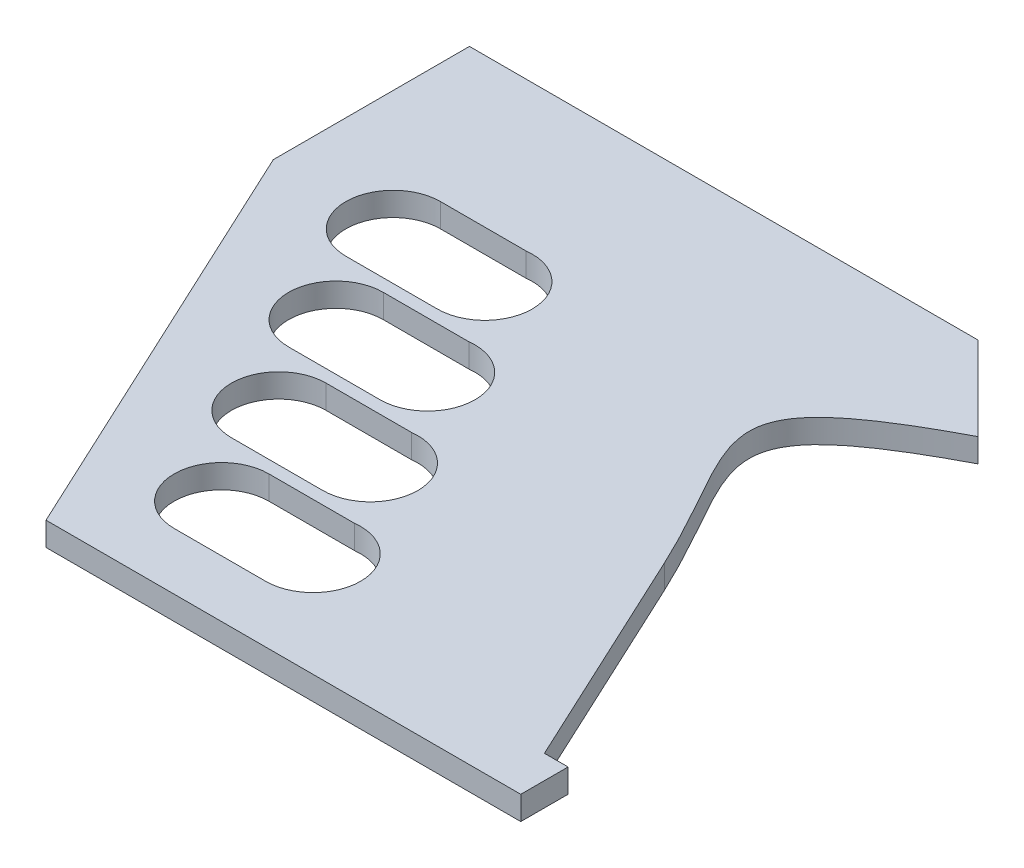
ISO-10303-21;
HEADER;
FILE_DESCRIPTION(('STEP AP214'),'2;1');
FILE_NAME('part.step','',(''),(''),'','','');
FILE_SCHEMA(('AUTOMOTIVE_DESIGN { 1 0 10303 214 1 1 1 1 }'));
ENDSEC;
DATA;
#1=APPLICATION_CONTEXT('core data for automotive mechanical design processes');
#2=APPLICATION_PROTOCOL_DEFINITION('international standard','automotive_design',2000,#1);
#3=PRODUCT_CONTEXT('',#1,'mechanical');
#4=PRODUCT('Part','Part','',(#3));
#5=PRODUCT_RELATED_PRODUCT_CATEGORY('part','',(#4));
#6=PRODUCT_DEFINITION_FORMATION('','',#4);
#7=PRODUCT_DEFINITION_CONTEXT('part definition',#1,'design');
#8=PRODUCT_DEFINITION('design','',#6,#7);
#9=PRODUCT_DEFINITION_SHAPE('','',#8);
#10=(LENGTH_UNIT() NAMED_UNIT(*) SI_UNIT(.MILLI.,.METRE.));
#11=(NAMED_UNIT(*) PLANE_ANGLE_UNIT() SI_UNIT($,.RADIAN.));
#12=(NAMED_UNIT(*) SI_UNIT($,.STERADIAN.) SOLID_ANGLE_UNIT());
#13=UNCERTAINTY_MEASURE_WITH_UNIT(LENGTH_MEASURE(1.E-05),#10,'distance_accuracy_value','');
#14=(GEOMETRIC_REPRESENTATION_CONTEXT(3) GLOBAL_UNCERTAINTY_ASSIGNED_CONTEXT((#13)) GLOBAL_UNIT_ASSIGNED_CONTEXT((#10,
#11,#12)) REPRESENTATION_CONTEXT('',''));
#15=CARTESIAN_POINT('',(0.,0.,0.));
#16=DIRECTION('',(0.,0.,1.));
#17=DIRECTION('',(1.,0.,0.));
#18=AXIS2_PLACEMENT_3D('',#15,#16,#17);
#19=CARTESIAN_POINT('',(29.4240304492377,5.,-17.6776695296636));
#20=DIRECTION('',(-0.707106781186543,0.,0.707106781186552));
#21=DIRECTION('',(0.707106781186552,0.,0.707106781186543));
#22=AXIS2_PLACEMENT_3D('',#19,#20,#21);
#23=PLANE('',#22);
#24=DIRECTION('',(-0.707106781186552,0.,-0.707106781186543));
#25=VECTOR('',#24,1.);
#26=CARTESIAN_POINT('',(29.4240304492377,0.,-17.6776695296636));
#27=LINE('',#26,#25);
#28=CARTESIAN_POINT('',(47.1016999789015,0.,0.));
#29=VERTEX_POINT('',#28);
#30=CARTESIAN_POINT('',(29.4240304492377,0.,-17.6776695296636));
#31=VERTEX_POINT('',#30);
#32=EDGE_CURVE('E328',#29,#31,#27,.T.);
#33=ORIENTED_EDGE('',*,*,#32,.T.);
#34=DIRECTION('',(0.,-1.,0.));
#35=VECTOR('',#34,1.);
#36=CARTESIAN_POINT('',(29.4240304492377,5.,-17.6776695296636));
#37=LINE('',#36,#35);
#38=CARTESIAN_POINT('',(29.4240304492377,5.,-17.6776695296636));
#39=VERTEX_POINT('',#38);
#40=EDGE_CURVE('E12',#39,#31,#37,.T.);
#41=ORIENTED_EDGE('',*,*,#40,.F.);
#42=DIRECTION('',(-0.707106781186552,0.,-0.707106781186543));
#43=VECTOR('',#42,1.);
#44=CARTESIAN_POINT('',(29.4240304492377,5.,-17.6776695296636));
#45=LINE('',#44,#43);
#46=CARTESIAN_POINT('',(47.1016999789015,5.,0.));
#47=VERTEX_POINT('',#46);
#48=EDGE_CURVE('E335',#47,#39,#45,.T.);
#49=ORIENTED_EDGE('',*,*,#48,.F.);
#50=DIRECTION('',(0.,-1.,0.));
#51=VECTOR('',#50,1.);
#52=CARTESIAN_POINT('',(47.1016999789015,5.,0.));
#53=LINE('',#52,#51);
#54=EDGE_CURVE('E358',#47,#29,#53,.T.);
#55=ORIENTED_EDGE('',*,*,#54,.T.);
#56=EDGE_LOOP('',(#33,#41,#49,#55));
#57=FACE_BOUND('',#56,.T.);
#58=ADVANCED_FACE('F36',(#57),#23,.F.);
#59=CARTESIAN_POINT('',(29.4240304492377,5.,-17.6776695296636));
#60=DIRECTION('',(0.,0.,1.));
#61=DIRECTION('',(1.,0.,0.));
#62=AXIS2_PLACEMENT_3D('',#59,#60,#61);
#63=PLANE('',#62);
#64=DIRECTION('',(-1.,0.,0.));
#65=VECTOR('',#64,1.);
#66=CARTESIAN_POINT('',(29.4240304492377,0.,-17.6776695296636));
#67=LINE('',#66,#65);
#68=CARTESIAN_POINT('',(-78.0525825981431,0.,-17.6776695296636));
#69=VERTEX_POINT('',#68);
#70=EDGE_CURVE('E402',#31,#69,#67,.T.);
#71=ORIENTED_EDGE('',*,*,#70,.T.);
#72=DIRECTION('',(0.,-1.,0.));
#73=VECTOR('',#72,1.);
#74=CARTESIAN_POINT('',(-78.0525825981431,5.,-17.6776695296636));
#75=LINE('',#74,#73);
#76=CARTESIAN_POINT('',(-78.0525825981431,5.,-17.6776695296636));
#77=VERTEX_POINT('',#76);
#78=EDGE_CURVE('E43',#77,#69,#75,.T.);
#79=ORIENTED_EDGE('',*,*,#78,.F.);
#80=DIRECTION('',(-1.,0.,0.));
#81=VECTOR('',#80,1.);
#82=CARTESIAN_POINT('',(29.4240304492377,5.,-17.6776695296636));
#83=LINE('',#82,#81);
#84=EDGE_CURVE('E338',#39,#77,#83,.T.);
#85=ORIENTED_EDGE('',*,*,#84,.F.);
#86=ORIENTED_EDGE('',*,*,#40,.T.);
#87=EDGE_LOOP('',(#71,#79,#85,#86));
#88=FACE_BOUND('',#87,.T.);
#89=ADVANCED_FACE('F393',(#88),#63,.F.);
#90=CARTESIAN_POINT('',(-78.0525825981431,5.,-17.6776695296636));
#91=DIRECTION('',(1.,0.,0.));
#92=DIRECTION('',(0.,0.,-1.));
#93=AXIS2_PLACEMENT_3D('',#90,#91,#92);
#94=PLANE('',#93);
#95=DIRECTION('',(0.,0.,1.));
#96=VECTOR('',#95,1.);
#97=CARTESIAN_POINT('',(-78.0525825981431,0.,-17.6776695296636));
#98=LINE('',#97,#96);
#99=CARTESIAN_POINT('',(-78.0525825981431,0.,23.7799884102785));
#100=VERTEX_POINT('',#99);
#101=EDGE_CURVE('E410',#69,#100,#98,.T.);
#102=ORIENTED_EDGE('',*,*,#101,.T.);
#103=DIRECTION('',(0.,-1.,0.));
#104=VECTOR('',#103,1.);
#105=CARTESIAN_POINT('',(-78.0525825981431,5.,23.7799884102785));
#106=LINE('',#105,#104);
#107=CARTESIAN_POINT('',(-78.0525825981431,5.,23.7799884102785));
#108=VERTEX_POINT('',#107);
#109=EDGE_CURVE('E413',#108,#100,#106,.T.);
#110=ORIENTED_EDGE('',*,*,#109,.F.);
#111=DIRECTION('',(0.,0.,1.));
#112=VECTOR('',#111,1.);
#113=CARTESIAN_POINT('',(-78.0525825981431,5.,-17.6776695296636));
#114=LINE('',#113,#112);
#115=EDGE_CURVE('E341',#77,#108,#114,.T.);
#116=ORIENTED_EDGE('',*,*,#115,.F.);
#117=ORIENTED_EDGE('',*,*,#78,.T.);
#118=EDGE_LOOP('',(#102,#110,#116,#117));
#119=FACE_BOUND('',#118,.T.);
#120=ADVANCED_FACE('F390',(#119),#94,.F.);
#121=CARTESIAN_POINT('',(-78.0525825981431,5.,23.7799884102785));
#122=DIRECTION('',(0.906307787036651,0.,-0.422618261740697));
#123=DIRECTION('',(-0.422618261740697,0.,-0.906307787036651));
#124=AXIS2_PLACEMENT_3D('',#121,#122,#123);
#125=PLANE('',#124);
#126=DIRECTION('',(0.422618261740697,0.,0.906307787036651));
#127=VECTOR('',#126,1.);
#128=CARTESIAN_POINT('',(-78.0525825981431,0.,23.7799884102785));
#129=LINE('',#128,#127);
#130=CARTESIAN_POINT('',(-36.0848933641935,0.,113.779988410278));
#131=VERTEX_POINT('',#130);
#132=EDGE_CURVE('E416',#100,#131,#129,.T.);
#133=ORIENTED_EDGE('',*,*,#132,.T.);
#134=DIRECTION('',(0.,-1.,0.));
#135=VECTOR('',#134,1.);
#136=CARTESIAN_POINT('',(-36.0848933641935,5.,113.779988410278));
#137=LINE('',#136,#135);
#138=CARTESIAN_POINT('',(-36.0848933641935,5.,113.779988410278));
#139=VERTEX_POINT('',#138);
#140=EDGE_CURVE('E448',#139,#131,#137,.T.);
#141=ORIENTED_EDGE('',*,*,#140,.F.);
#142=DIRECTION('',(0.422618261740697,0.,0.906307787036651));
#143=VECTOR('',#142,1.);
#144=CARTESIAN_POINT('',(-78.0525825981431,5.,23.7799884102785));
#145=LINE('',#144,#143);
#146=EDGE_CURVE('E343',#108,#139,#145,.T.);
#147=ORIENTED_EDGE('',*,*,#146,.F.);
#148=ORIENTED_EDGE('',*,*,#109,.T.);
#149=EDGE_LOOP('',(#133,#141,#147,#148));
#150=FACE_BOUND('',#149,.T.);
#151=ADVANCED_FACE('F386',(#150),#125,.F.);
#152=CARTESIAN_POINT('',(-36.0848933641935,5.,113.779988410278));
#153=DIRECTION('',(0.,0.,-1.));
#154=DIRECTION('',(-1.,0.,0.));
#155=AXIS2_PLACEMENT_3D('',#152,#153,#154);
#156=PLANE('',#155);
#157=DIRECTION('',(1.,0.,0.));
#158=VECTOR('',#157,1.);
#159=CARTESIAN_POINT('',(-36.0848933641935,0.,113.779988410278));
#160=LINE('',#159,#158);
#161=CARTESIAN_POINT('',(64.2520300542566,0.,113.779988410278));
#162=VERTEX_POINT('',#161);
#163=EDGE_CURVE('E418',#131,#162,#160,.T.);
#164=ORIENTED_EDGE('',*,*,#163,.T.);
#165=DIRECTION('',(0.,-1.,0.));
#166=VECTOR('',#165,1.);
#167=CARTESIAN_POINT('',(64.2520300542566,5.,113.779988410278));
#168=LINE('',#167,#166);
#169=CARTESIAN_POINT('',(64.2520300542566,5.,113.779988410278));
#170=VERTEX_POINT('',#169);
#171=EDGE_CURVE('E445',#170,#162,#168,.T.);
#172=ORIENTED_EDGE('',*,*,#171,.F.);
#173=DIRECTION('',(1.,0.,0.));
#174=VECTOR('',#173,1.);
#175=CARTESIAN_POINT('',(-36.0848933641935,5.,113.779988410278));
#176=LINE('',#175,#174);
#177=EDGE_CURVE('E345',#139,#170,#176,.T.);
#178=ORIENTED_EDGE('',*,*,#177,.F.);
#179=ORIENTED_EDGE('',*,*,#140,.T.);
#180=EDGE_LOOP('',(#164,#172,#178,#179));
#181=FACE_BOUND('',#180,.T.);
#182=ADVANCED_FACE('F382',(#181),#156,.F.);
#183=CARTESIAN_POINT('',(64.2520300542566,5.,113.779988410278));
#184=DIRECTION('',(-1.,0.,0.));
#185=DIRECTION('',(0.,0.,1.));
#186=AXIS2_PLACEMENT_3D('',#183,#184,#185);
#187=PLANE('',#186);
#188=DIRECTION('',(0.,0.,-1.));
#189=VECTOR('',#188,1.);
#190=CARTESIAN_POINT('',(64.2520300542566,0.,113.779988410278));
#191=LINE('',#190,#189);
#192=CARTESIAN_POINT('',(64.2520300542566,0.,103.779988410278));
#193=VERTEX_POINT('',#192);
#194=EDGE_CURVE('E422',#162,#193,#191,.T.);
#195=ORIENTED_EDGE('',*,*,#194,.T.);
#196=DIRECTION('',(0.,-1.,0.));
#197=VECTOR('',#196,1.);
#198=CARTESIAN_POINT('',(64.2520300542566,5.,103.779988410278));
#199=LINE('',#198,#197);
#200=CARTESIAN_POINT('',(64.2520300542566,5.,103.779988410278));
#201=VERTEX_POINT('',#200);
#202=EDGE_CURVE('E442',#201,#193,#199,.T.);
#203=ORIENTED_EDGE('',*,*,#202,.F.);
#204=DIRECTION('',(0.,0.,-1.));
#205=VECTOR('',#204,1.);
#206=CARTESIAN_POINT('',(64.2520300542566,5.,113.779988410278));
#207=LINE('',#206,#205);
#208=EDGE_CURVE('E347',#170,#201,#207,.T.);
#209=ORIENTED_EDGE('',*,*,#208,.F.);
#210=ORIENTED_EDGE('',*,*,#171,.T.);
#211=EDGE_LOOP('',(#195,#203,#209,#210));
#212=FACE_BOUND('',#211,.T.);
#213=ADVANCED_FACE('F378',(#212),#187,.F.);
#214=CARTESIAN_POINT('',(64.2520300542566,5.,103.779988410278));
#215=DIRECTION('',(0.,0.,1.));
#216=DIRECTION('',(1.,0.,0.));
#217=AXIS2_PLACEMENT_3D('',#214,#215,#216);
#218=PLANE('',#217);
#219=DIRECTION('',(-1.,0.,0.));
#220=VECTOR('',#219,1.);
#221=CARTESIAN_POINT('',(64.2520300542566,0.,103.779988410278));
#222=LINE('',#221,#220);
#223=CARTESIAN_POINT('',(59.2520300542566,0.,103.779988410278));
#224=VERTEX_POINT('',#223);
#225=EDGE_CURVE('E424',#193,#224,#222,.T.);
#226=ORIENTED_EDGE('',*,*,#225,.T.);
#227=DIRECTION('',(0.,-1.,0.));
#228=VECTOR('',#227,1.);
#229=CARTESIAN_POINT('',(59.2520300542566,5.,103.779988410278));
#230=LINE('',#229,#228);
#231=CARTESIAN_POINT('',(59.2520300542566,5.,103.779988410278));
#232=VERTEX_POINT('',#231);
#233=EDGE_CURVE('E439',#232,#224,#230,.T.);
#234=ORIENTED_EDGE('',*,*,#233,.F.);
#235=DIRECTION('',(-1.,0.,0.));
#236=VECTOR('',#235,1.);
#237=CARTESIAN_POINT('',(64.2520300542566,5.,103.779988410278));
#238=LINE('',#237,#236);
#239=EDGE_CURVE('E349',#201,#232,#238,.T.);
#240=ORIENTED_EDGE('',*,*,#239,.F.);
#241=ORIENTED_EDGE('',*,*,#202,.T.);
#242=EDGE_LOOP('',(#226,#234,#240,#241));
#243=FACE_BOUND('',#242,.T.);
#244=ADVANCED_FACE('F374',(#243),#218,.F.);
#245=CARTESIAN_POINT('',(59.2520300542566,5.,103.779988410278));
#246=DIRECTION('',(-0.906307787036651,0.,0.422618261740698));
#247=DIRECTION('',(0.422618261740698,0.,0.906307787036651));
#248=AXIS2_PLACEMENT_3D('',#245,#246,#247);
#249=PLANE('',#248);
#250=DIRECTION('',(-0.422618261740698,0.,-0.906307787036651));
#251=VECTOR('',#250,1.);
#252=CARTESIAN_POINT('',(59.2520300542566,0.,103.779988410278));
#253=LINE('',#252,#251);
#254=CARTESIAN_POINT('',(37.1043773492888,0.,56.2841939114326));
#255=VERTEX_POINT('',#254);
#256=EDGE_CURVE('E426',#224,#255,#253,.T.);
#257=ORIENTED_EDGE('',*,*,#256,.T.);
#258=DIRECTION('',(0.,-1.,0.));
#259=VECTOR('',#258,1.);
#260=CARTESIAN_POINT('',(37.1043773492888,5.,56.2841939114326));
#261=LINE('',#260,#259);
#262=CARTESIAN_POINT('',(37.1043773492888,5.,56.2841939114326));
#263=VERTEX_POINT('',#262);
#264=EDGE_CURVE('E436',#263,#255,#261,.T.);
#265=ORIENTED_EDGE('',*,*,#264,.F.);
#266=DIRECTION('',(-0.422618261740698,0.,-0.906307787036651));
#267=VECTOR('',#266,1.);
#268=CARTESIAN_POINT('',(59.2520300542566,5.,103.779988410278));
#269=LINE('',#268,#267);
#270=EDGE_CURVE('E351',#232,#263,#269,.T.);
#271=ORIENTED_EDGE('',*,*,#270,.F.);
#272=ORIENTED_EDGE('',*,*,#233,.T.);
#273=EDGE_LOOP('',(#257,#265,#271,#272));
#274=FACE_BOUND('',#273,.T.);
#275=ADVANCED_FACE('F369',(#274),#249,.F.);
#276=CARTESIAN_POINT('',(37.1043773492888,5.,56.2841939114326));
#277=CARTESIAN_POINT('',(22.607602938361,5.,25.1957608621317));
#278=CARTESIAN_POINT('',(7.91637544928709,5.,20.5329928361789));
#279=CARTESIAN_POINT('',(47.1016999789015,5.,0.));
#280=B_SPLINE_CURVE_WITH_KNOTS('',3,(#276,#277,#278,#279),.UNSPECIFIED.,.F.,.F.,(4,4),(0.,1.),.UNSPECIFIED.);
#281=DIRECTION('',(0.,-1.,0.));
#282=VECTOR('',#281,1.);
#283=SURFACE_OF_LINEAR_EXTRUSION('',#280,#282);
#284=CARTESIAN_POINT('',(37.1043773492888,0.,56.2841939114326));
#285=CARTESIAN_POINT('',(22.607602938361,0.,25.1957608621317));
#286=CARTESIAN_POINT('',(7.91637544928709,0.,20.5329928361789));
#287=CARTESIAN_POINT('',(47.1016999789015,0.,0.));
#288=B_SPLINE_CURVE_WITH_KNOTS('',3,(#284,#285,#286,#287),.UNSPECIFIED.,.F.,.F.,(4,4),(0.,1.),.UNSPECIFIED.);
#289=EDGE_CURVE('E339',#255,#29,#288,.T.);
#290=ORIENTED_EDGE('',*,*,#289,.T.);
#291=ORIENTED_EDGE('',*,*,#54,.F.);
#292=EDGE_CURVE('E353',#263,#47,#280,.T.);
#293=ORIENTED_EDGE('',*,*,#292,.F.);
#294=ORIENTED_EDGE('',*,*,#264,.T.);
#295=EDGE_LOOP('',(#290,#291,#293,#294));
#296=FACE_BOUND('',#295,.T.);
#297=ADVANCED_FACE('F364',(#296),#283,.F.);
#298=CARTESIAN_POINT('',(21.9722515613918,5.,24.1838068757956));
#299=DIRECTION('',(0.,-1.,0.));
#300=DIRECTION('',(0.,0.,-1.));
#301=AXIS2_PLACEMENT_3D('',#298,#299,#300);
#302=PLANE('',#301);
#303=DIRECTION('',(1.,0.,0.));
#304=VECTOR('',#303,1.);
#305=CARTESIAN_POINT('',(-11.6931363860408,5.,101.753072438027));
#306=LINE('',#305,#304);
#307=CARTESIAN_POINT('',(-21.0192895491407,5.,101.753072438027));
#308=VERTEX_POINT('',#307);
#309=CARTESIAN_POINT('',(-1.69313638604082,5.,101.753072438027));
#310=VERTEX_POINT('',#309);
#311=EDGE_CURVE('E229',#308,#310,#306,.T.);
#312=ORIENTED_EDGE('',*,*,#311,.F.);
#313=CARTESIAN_POINT('',(-21.0192895491407,5.,91.7530724380273));
#314=DIRECTION('',(0.,1.,0.));
#315=DIRECTION('',(0.,0.,1.));
#316=AXIS2_PLACEMENT_3D('',#313,#314,#315);
#317=CIRCLE('',#316,10.);
#318=CARTESIAN_POINT('',(-21.0192895491407,5.,81.7530724380273));
#319=VERTEX_POINT('',#318);
#320=EDGE_CURVE('E50',#319,#308,#317,.T.);
#321=ORIENTED_EDGE('',*,*,#320,.F.);
#322=DIRECTION('',(-1.,0.,0.));
#323=VECTOR('',#322,1.);
#324=CARTESIAN_POINT('',(-21.0192895491407,5.,81.7530724380273));
#325=LINE('',#324,#323);
#326=CARTESIAN_POINT('',(-2.91410948383002,5.,81.7530724380273));
#327=VERTEX_POINT('',#326);
#328=EDGE_CURVE('E220',#327,#319,#325,.T.);
#329=ORIENTED_EDGE('',*,*,#328,.F.);
#330=CARTESIAN_POINT('',(-1.69313638604082,5.,91.7158030553892));
#331=DIRECTION('',(0.,1.,0.));
#332=DIRECTION('',(0.,0.,1.));
#333=AXIS2_PLACEMENT_3D('',#330,#331,#332);
#334=CIRCLE('',#333,10.0372693826381);
#335=EDGE_CURVE('E223',#310,#327,#334,.T.);
#336=ORIENTED_EDGE('',*,*,#335,.F.);
#337=EDGE_LOOP('',(#312,#321,#329,#336));
#338=FACE_BOUND('',#337,.T.);
#339=DIRECTION('',(1.,0.,0.));
#340=VECTOR('',#339,1.);
#341=CARTESIAN_POINT('',(-22.2585929295582,5.,79.0953777621111));
#342=LINE('',#341,#340);
#343=CARTESIAN_POINT('',(-31.5847460926582,5.,79.0953777621111));
#344=VERTEX_POINT('',#343);
#345=CARTESIAN_POINT('',(-12.2585929295582,5.,79.0953777621111));
#346=VERTEX_POINT('',#345);
#347=EDGE_CURVE('E254',#344,#346,#342,.T.);
#348=ORIENTED_EDGE('',*,*,#347,.F.);
#349=CARTESIAN_POINT('',(-31.5847460926582,5.,69.0953777621111));
#350=DIRECTION('',(0.,1.,0.));
#351=DIRECTION('',(0.,0.,1.));
#352=AXIS2_PLACEMENT_3D('',#349,#350,#351);
#353=CIRCLE('',#352,10.);
#354=CARTESIAN_POINT('',(-31.5847460926582,5.,59.095377762111));
#355=VERTEX_POINT('',#354);
#356=EDGE_CURVE('E235',#355,#344,#353,.T.);
#357=ORIENTED_EDGE('',*,*,#356,.F.);
#358=DIRECTION('',(-1.,0.,0.));
#359=VECTOR('',#358,1.);
#360=CARTESIAN_POINT('',(-31.5847460926582,5.,59.095377762111));
#361=LINE('',#360,#359);
#362=CARTESIAN_POINT('',(-13.4795660273474,5.,59.095377762111));
#363=VERTEX_POINT('',#362);
#364=EDGE_CURVE('E243',#363,#355,#361,.T.);
#365=ORIENTED_EDGE('',*,*,#364,.F.);
#366=CARTESIAN_POINT('',(-12.2585929295582,5.,69.0581083794729));
#367=DIRECTION('',(0.,1.,0.));
#368=DIRECTION('',(0.,0.,1.));
#369=AXIS2_PLACEMENT_3D('',#366,#367,#368);
#370=CIRCLE('',#369,10.0372693826381);
#371=EDGE_CURVE('E257',#346,#363,#370,.T.);
#372=ORIENTED_EDGE('',*,*,#371,.F.);
#373=EDGE_LOOP('',(#348,#357,#365,#372));
#374=FACE_BOUND('',#373,.T.);
#375=DIRECTION('',(1.,0.,0.));
#376=VECTOR('',#375,1.);
#377=CARTESIAN_POINT('',(-32.8240494730757,5.,56.4376830861948));
#378=LINE('',#377,#376);
#379=CARTESIAN_POINT('',(-42.1502026361756,5.,56.4376830861948));
#380=VERTEX_POINT('',#379);
#381=CARTESIAN_POINT('',(-22.8240494730757,5.,56.4376830861948));
#382=VERTEX_POINT('',#381);
#383=EDGE_CURVE('E286',#380,#382,#378,.T.);
#384=ORIENTED_EDGE('',*,*,#383,.F.);
#385=CARTESIAN_POINT('',(-42.1502026361756,5.,46.4376830861948));
#386=DIRECTION('',(0.,1.,0.));
#387=DIRECTION('',(0.,0.,1.));
#388=AXIS2_PLACEMENT_3D('',#385,#386,#387);
#389=CIRCLE('',#388,10.);
#390=CARTESIAN_POINT('',(-42.1502026361756,5.,36.4376830861948));
#391=VERTEX_POINT('',#390);
#392=EDGE_CURVE('E264',#391,#380,#389,.T.);
#393=ORIENTED_EDGE('',*,*,#392,.F.);
#394=DIRECTION('',(-1.,0.,0.));
#395=VECTOR('',#394,1.);
#396=CARTESIAN_POINT('',(-42.1502026361756,5.,36.4376830861948));
#397=LINE('',#396,#395);
#398=CARTESIAN_POINT('',(-24.0450225708649,5.,36.4376830861948));
#399=VERTEX_POINT('',#398);
#400=EDGE_CURVE('E275',#399,#391,#397,.T.);
#401=ORIENTED_EDGE('',*,*,#400,.F.);
#402=CARTESIAN_POINT('',(-22.8240494730757,5.,46.4004137035566));
#403=DIRECTION('',(0.,1.,0.));
#404=DIRECTION('',(0.,0.,1.));
#405=AXIS2_PLACEMENT_3D('',#402,#403,#404);
#406=CIRCLE('',#405,10.0372693826381);
#407=EDGE_CURVE('E289',#382,#399,#406,.T.);
#408=ORIENTED_EDGE('',*,*,#407,.F.);
#409=EDGE_LOOP('',(#384,#393,#401,#408));
#410=FACE_BOUND('',#409,.T.);
#411=DIRECTION('',(1.,0.,0.));
#412=VECTOR('',#411,1.);
#413=CARTESIAN_POINT('',(-43.3895060165931,5.,33.7799884102785));
#414=LINE('',#413,#412);
#415=CARTESIAN_POINT('',(-52.715659179693,5.,33.7799884102785));
#416=VERTEX_POINT('',#415);
#417=CARTESIAN_POINT('',(-33.3895060165931,5.,33.7799884102785));
#418=VERTEX_POINT('',#417);
#419=EDGE_CURVE('E318',#416,#418,#414,.T.);
#420=ORIENTED_EDGE('',*,*,#419,.F.);
#421=CARTESIAN_POINT('',(-52.715659179693,5.,23.7799884102785));
#422=DIRECTION('',(0.,1.,0.));
#423=DIRECTION('',(0.,0.,1.));
#424=AXIS2_PLACEMENT_3D('',#421,#422,#423);
#425=CIRCLE('',#424,10.);
#426=CARTESIAN_POINT('',(-52.715659179693,5.,13.7799884102785));
#427=VERTEX_POINT('',#426);
#428=EDGE_CURVE('E296',#427,#416,#425,.T.);
#429=ORIENTED_EDGE('',*,*,#428,.F.);
#430=DIRECTION('',(-1.,0.,0.));
#431=VECTOR('',#430,1.);
#432=CARTESIAN_POINT('',(-52.715659179693,5.,13.7799884102785));
#433=LINE('',#432,#431);
#434=CARTESIAN_POINT('',(-34.6104791143823,5.,13.7799884102785));
#435=VERTEX_POINT('',#434);
#436=EDGE_CURVE('E307',#435,#427,#433,.T.);
#437=ORIENTED_EDGE('',*,*,#436,.F.);
#438=CARTESIAN_POINT('',(-33.3895060165931,5.,23.7427190276404));
#439=DIRECTION('',(0.,1.,0.));
#440=DIRECTION('',(0.,0.,1.));
#441=AXIS2_PLACEMENT_3D('',#438,#439,#440);
#442=CIRCLE('',#441,10.0372693826381);
#443=EDGE_CURVE('E321',#418,#435,#442,.T.);
#444=ORIENTED_EDGE('',*,*,#443,.F.);
#445=EDGE_LOOP('',(#420,#429,#437,#444));
#446=FACE_BOUND('',#445,.T.);
#447=ORIENTED_EDGE('',*,*,#48,.T.);
#448=ORIENTED_EDGE('',*,*,#84,.T.);
#449=ORIENTED_EDGE('',*,*,#115,.T.);
#450=ORIENTED_EDGE('',*,*,#146,.T.);
#451=ORIENTED_EDGE('',*,*,#177,.T.);
#452=ORIENTED_EDGE('',*,*,#208,.T.);
#453=ORIENTED_EDGE('',*,*,#239,.T.);
#454=ORIENTED_EDGE('',*,*,#270,.T.);
#455=ORIENTED_EDGE('',*,*,#292,.T.);
#456=EDGE_LOOP('',(#447,#448,#449,#450,#451,#452,#453,#454,#455));
#457=FACE_BOUND('',#456,.T.);
#458=ADVANCED_FACE('F368',(#338,#374,#410,#446,#457),#302,.F.);
#459=CARTESIAN_POINT('',(21.9722515613918,0.,24.1838068757956));
#460=DIRECTION('',(0.,-1.,0.));
#461=DIRECTION('',(0.,0.,-1.));
#462=AXIS2_PLACEMENT_3D('',#459,#460,#461);
#463=PLANE('',#462);
#464=CARTESIAN_POINT('',(-21.0192895491407,0.,91.7530724380273));
#465=DIRECTION('',(0.,1.,0.));
#466=DIRECTION('',(0.,0.,1.));
#467=AXIS2_PLACEMENT_3D('',#464,#465,#466);
#468=CIRCLE('',#467,10.);
#469=CARTESIAN_POINT('',(-21.0192895491407,0.,81.7530724380273));
#470=VERTEX_POINT('',#469);
#471=CARTESIAN_POINT('',(-21.0192895491407,0.,101.753072438027));
#472=VERTEX_POINT('',#471);
#473=EDGE_CURVE('E204',#470,#472,#468,.T.);
#474=ORIENTED_EDGE('',*,*,#473,.T.);
#475=DIRECTION('',(1.,0.,0.));
#476=VECTOR('',#475,1.);
#477=CARTESIAN_POINT('',(-21.0192895491407,0.,101.753072438027));
#478=LINE('',#477,#476);
#479=CARTESIAN_POINT('',(-1.69313638604082,0.,101.753072438027));
#480=VERTEX_POINT('',#479);
#481=EDGE_CURVE('E213',#472,#480,#478,.T.);
#482=ORIENTED_EDGE('',*,*,#481,.T.);
#483=CARTESIAN_POINT('',(-1.69313638604082,0.,91.7158030553892));
#484=DIRECTION('',(0.,1.,0.));
#485=DIRECTION('',(0.,0.,1.));
#486=AXIS2_PLACEMENT_3D('',#483,#484,#485);
#487=CIRCLE('',#486,10.0372693826381);
#488=CARTESIAN_POINT('',(-2.91410948383002,0.,81.7530724380273));
#489=VERTEX_POINT('',#488);
#490=EDGE_CURVE('E58',#480,#489,#487,.T.);
#491=ORIENTED_EDGE('',*,*,#490,.T.);
#492=DIRECTION('',(-1.,0.,0.));
#493=VECTOR('',#492,1.);
#494=CARTESIAN_POINT('',(-11.0192895491407,0.,81.7530724380273));
#495=LINE('',#494,#493);
#496=EDGE_CURVE('E210',#489,#470,#495,.T.);
#497=ORIENTED_EDGE('',*,*,#496,.T.);
#498=EDGE_LOOP('',(#474,#482,#491,#497));
#499=FACE_BOUND('',#498,.T.);
#500=CARTESIAN_POINT('',(-31.5847460926582,0.,69.0953777621111));
#501=DIRECTION('',(0.,1.,0.));
#502=DIRECTION('',(0.,0.,1.));
#503=AXIS2_PLACEMENT_3D('',#500,#501,#502);
#504=CIRCLE('',#503,10.);
#505=CARTESIAN_POINT('',(-31.5847460926582,0.,59.095377762111));
#506=VERTEX_POINT('',#505);
#507=CARTESIAN_POINT('',(-31.5847460926582,0.,79.0953777621111));
#508=VERTEX_POINT('',#507);
#509=EDGE_CURVE('E239',#506,#508,#504,.T.);
#510=ORIENTED_EDGE('',*,*,#509,.T.);
#511=DIRECTION('',(1.,0.,0.));
#512=VECTOR('',#511,1.);
#513=CARTESIAN_POINT('',(-31.5847460926582,0.,79.0953777621111));
#514=LINE('',#513,#512);
#515=CARTESIAN_POINT('',(-12.2585929295582,0.,79.0953777621111));
#516=VERTEX_POINT('',#515);
#517=EDGE_CURVE('E242',#508,#516,#514,.T.);
#518=ORIENTED_EDGE('',*,*,#517,.T.);
#519=CARTESIAN_POINT('',(-12.2585929295582,0.,69.0581083794729));
#520=DIRECTION('',(0.,1.,0.));
#521=DIRECTION('',(0.,0.,1.));
#522=AXIS2_PLACEMENT_3D('',#519,#520,#521);
#523=CIRCLE('',#522,10.0372693826381);
#524=CARTESIAN_POINT('',(-13.4795660273474,0.,59.095377762111));
#525=VERTEX_POINT('',#524);
#526=EDGE_CURVE('E246',#516,#525,#523,.T.);
#527=ORIENTED_EDGE('',*,*,#526,.T.);
#528=DIRECTION('',(-1.,0.,0.));
#529=VECTOR('',#528,1.);
#530=CARTESIAN_POINT('',(-21.5847460926582,0.,59.095377762111));
#531=LINE('',#530,#529);
#532=EDGE_CURVE('E249',#525,#506,#531,.T.);
#533=ORIENTED_EDGE('',*,*,#532,.T.);
#534=EDGE_LOOP('',(#510,#518,#527,#533));
#535=FACE_BOUND('',#534,.T.);
#536=CARTESIAN_POINT('',(-42.1502026361756,0.,46.4376830861948));
#537=DIRECTION('',(0.,1.,0.));
#538=DIRECTION('',(0.,0.,1.));
#539=AXIS2_PLACEMENT_3D('',#536,#537,#538);
#540=CIRCLE('',#539,10.);
#541=CARTESIAN_POINT('',(-42.1502026361756,0.,36.4376830861948));
#542=VERTEX_POINT('',#541);
#543=CARTESIAN_POINT('',(-42.1502026361756,0.,56.4376830861948));
#544=VERTEX_POINT('',#543);
#545=EDGE_CURVE('E271',#542,#544,#540,.T.);
#546=ORIENTED_EDGE('',*,*,#545,.T.);
#547=DIRECTION('',(1.,0.,0.));
#548=VECTOR('',#547,1.);
#549=CARTESIAN_POINT('',(-42.1502026361756,0.,56.4376830861948));
#550=LINE('',#549,#548);
#551=CARTESIAN_POINT('',(-22.8240494730757,0.,56.4376830861948));
#552=VERTEX_POINT('',#551);
#553=EDGE_CURVE('E274',#544,#552,#550,.T.);
#554=ORIENTED_EDGE('',*,*,#553,.T.);
#555=CARTESIAN_POINT('',(-22.8240494730757,0.,46.4004137035566));
#556=DIRECTION('',(0.,1.,0.));
#557=DIRECTION('',(0.,0.,1.));
#558=AXIS2_PLACEMENT_3D('',#555,#556,#557);
#559=CIRCLE('',#558,10.0372693826381);
#560=CARTESIAN_POINT('',(-24.0450225708649,0.,36.4376830861948));
#561=VERTEX_POINT('',#560);
#562=EDGE_CURVE('E278',#552,#561,#559,.T.);
#563=ORIENTED_EDGE('',*,*,#562,.T.);
#564=DIRECTION('',(-1.,0.,0.));
#565=VECTOR('',#564,1.);
#566=CARTESIAN_POINT('',(-32.1502026361756,0.,36.4376830861948));
#567=LINE('',#566,#565);
#568=EDGE_CURVE('E281',#561,#542,#567,.T.);
#569=ORIENTED_EDGE('',*,*,#568,.T.);
#570=EDGE_LOOP('',(#546,#554,#563,#569));
#571=FACE_BOUND('',#570,.T.);
#572=CARTESIAN_POINT('',(-52.715659179693,0.,23.7799884102785));
#573=DIRECTION('',(0.,1.,0.));
#574=DIRECTION('',(0.,0.,1.));
#575=AXIS2_PLACEMENT_3D('',#572,#573,#574);
#576=CIRCLE('',#575,10.);
#577=CARTESIAN_POINT('',(-52.715659179693,0.,13.7799884102785));
#578=VERTEX_POINT('',#577);
#579=CARTESIAN_POINT('',(-52.715659179693,0.,33.7799884102785));
#580=VERTEX_POINT('',#579);
#581=EDGE_CURVE('E303',#578,#580,#576,.T.);
#582=ORIENTED_EDGE('',*,*,#581,.T.);
#583=DIRECTION('',(1.,0.,0.));
#584=VECTOR('',#583,1.);
#585=CARTESIAN_POINT('',(-52.715659179693,0.,33.7799884102785));
#586=LINE('',#585,#584);
#587=CARTESIAN_POINT('',(-33.3895060165931,0.,33.7799884102785));
#588=VERTEX_POINT('',#587);
#589=EDGE_CURVE('E306',#580,#588,#586,.T.);
#590=ORIENTED_EDGE('',*,*,#589,.T.);
#591=CARTESIAN_POINT('',(-33.3895060165931,0.,23.7427190276404));
#592=DIRECTION('',(0.,1.,0.));
#593=DIRECTION('',(0.,0.,1.));
#594=AXIS2_PLACEMENT_3D('',#591,#592,#593);
#595=CIRCLE('',#594,10.0372693826381);
#596=CARTESIAN_POINT('',(-34.6104791143823,0.,13.7799884102785));
#597=VERTEX_POINT('',#596);
#598=EDGE_CURVE('E310',#588,#597,#595,.T.);
#599=ORIENTED_EDGE('',*,*,#598,.T.);
#600=DIRECTION('',(-1.,0.,0.));
#601=VECTOR('',#600,1.);
#602=CARTESIAN_POINT('',(-42.715659179693,0.,13.7799884102785));
#603=LINE('',#602,#601);
#604=EDGE_CURVE('E313',#597,#578,#603,.T.);
#605=ORIENTED_EDGE('',*,*,#604,.T.);
#606=EDGE_LOOP('',(#582,#590,#599,#605));
#607=FACE_BOUND('',#606,.T.);
#608=ORIENTED_EDGE('',*,*,#32,.F.);
#609=ORIENTED_EDGE('',*,*,#289,.F.);
#610=ORIENTED_EDGE('',*,*,#256,.F.);
#611=ORIENTED_EDGE('',*,*,#225,.F.);
#612=ORIENTED_EDGE('',*,*,#194,.F.);
#613=ORIENTED_EDGE('',*,*,#163,.F.);
#614=ORIENTED_EDGE('',*,*,#132,.F.);
#615=ORIENTED_EDGE('',*,*,#101,.F.);
#616=ORIENTED_EDGE('',*,*,#70,.F.);
#617=EDGE_LOOP('',(#608,#609,#610,#611,#612,#613,#614,#615,#616));
#618=FACE_BOUND('',#617,.T.);
#619=ADVANCED_FACE('F217',(#499,#535,#571,#607,#618),#463,.T.);
#620=CARTESIAN_POINT('',(-52.715659179693,0.,23.7799884102785));
#621=DIRECTION('',(0.,1.,0.));
#622=DIRECTION('',(0.,0.,1.));
#623=AXIS2_PLACEMENT_3D('',#620,#621,#622);
#624=CYLINDRICAL_SURFACE('',#623,10.);
#625=ORIENTED_EDGE('',*,*,#428,.T.);
#626=DIRECTION('',(0.,1.,0.));
#627=VECTOR('',#626,1.);
#628=CARTESIAN_POINT('',(-52.715659179693,0.,33.7799884102785));
#629=LINE('',#628,#627);
#630=EDGE_CURVE('E316',#580,#416,#629,.T.);
#631=ORIENTED_EDGE('',*,*,#630,.F.);
#632=ORIENTED_EDGE('',*,*,#581,.F.);
#633=DIRECTION('',(0.,1.,0.));
#634=VECTOR('',#633,1.);
#635=CARTESIAN_POINT('',(-52.715659179693,0.,13.7799884102785));
#636=LINE('',#635,#634);
#637=EDGE_CURVE('E326',#578,#427,#636,.T.);
#638=ORIENTED_EDGE('',*,*,#637,.T.);
#639=EDGE_LOOP('',(#625,#631,#632,#638));
#640=FACE_BOUND('',#639,.T.);
#641=ADVANCED_FACE('F474',(#640),#624,.F.);
#642=CARTESIAN_POINT('',(-52.715659179693,0.,13.7799884102785));
#643=DIRECTION('',(0.,0.,-1.));
#644=DIRECTION('',(-1.,0.,0.));
#645=AXIS2_PLACEMENT_3D('',#642,#643,#644);
#646=PLANE('',#645);
#647=ORIENTED_EDGE('',*,*,#436,.T.);
#648=ORIENTED_EDGE('',*,*,#637,.F.);
#649=ORIENTED_EDGE('',*,*,#604,.F.);
#650=DIRECTION('',(0.,1.,0.));
#651=VECTOR('',#650,1.);
#652=CARTESIAN_POINT('',(-34.6104791143823,0.,13.7799884102785));
#653=LINE('',#652,#651);
#654=EDGE_CURVE('E329',#597,#435,#653,.T.);
#655=ORIENTED_EDGE('',*,*,#654,.T.);
#656=EDGE_LOOP('',(#647,#648,#649,#655));
#657=FACE_BOUND('',#656,.T.);
#658=ADVANCED_FACE('F479',(#657),#646,.F.);
#659=CARTESIAN_POINT('',(-33.3895060165931,0.,23.7427190276404));
#660=DIRECTION('',(0.,1.,0.));
#661=DIRECTION('',(0.,0.,1.));
#662=AXIS2_PLACEMENT_3D('',#659,#660,#661);
#663=CYLINDRICAL_SURFACE('',#662,10.0372693826381);
#664=ORIENTED_EDGE('',*,*,#443,.T.);
#665=ORIENTED_EDGE('',*,*,#654,.F.);
#666=ORIENTED_EDGE('',*,*,#598,.F.);
#667=DIRECTION('',(0.,1.,0.));
#668=VECTOR('',#667,1.);
#669=CARTESIAN_POINT('',(-33.3895060165931,0.,33.7799884102785));
#670=LINE('',#669,#668);
#671=EDGE_CURVE('E331',#588,#418,#670,.T.);
#672=ORIENTED_EDGE('',*,*,#671,.T.);
#673=EDGE_LOOP('',(#664,#665,#666,#672));
#674=FACE_BOUND('',#673,.T.);
#675=ADVANCED_FACE('F485',(#674),#663,.F.);
#676=CARTESIAN_POINT('',(-43.3895060165931,0.,33.7799884102785));
#677=DIRECTION('',(0.,0.,1.));
#678=DIRECTION('',(1.,0.,0.));
#679=AXIS2_PLACEMENT_3D('',#676,#677,#678);
#680=PLANE('',#679);
#681=ORIENTED_EDGE('',*,*,#419,.T.);
#682=ORIENTED_EDGE('',*,*,#671,.F.);
#683=ORIENTED_EDGE('',*,*,#589,.F.);
#684=ORIENTED_EDGE('',*,*,#630,.T.);
#685=EDGE_LOOP('',(#681,#682,#683,#684));
#686=FACE_BOUND('',#685,.T.);
#687=ADVANCED_FACE('F481',(#686),#680,.F.);
#688=CARTESIAN_POINT('',(-42.1502026361756,0.,46.4376830861948));
#689=DIRECTION('',(0.,1.,0.));
#690=DIRECTION('',(0.,0.,1.));
#691=AXIS2_PLACEMENT_3D('',#688,#689,#690);
#692=CYLINDRICAL_SURFACE('',#691,10.);
#693=ORIENTED_EDGE('',*,*,#392,.T.);
#694=DIRECTION('',(0.,1.,0.));
#695=VECTOR('',#694,1.);
#696=CARTESIAN_POINT('',(-42.1502026361756,0.,56.4376830861948));
#697=LINE('',#696,#695);
#698=EDGE_CURVE('E284',#544,#380,#697,.T.);
#699=ORIENTED_EDGE('',*,*,#698,.F.);
#700=ORIENTED_EDGE('',*,*,#545,.F.);
#701=DIRECTION('',(0.,1.,0.));
#702=VECTOR('',#701,1.);
#703=CARTESIAN_POINT('',(-42.1502026361756,0.,36.4376830861948));
#704=LINE('',#703,#702);
#705=EDGE_CURVE('E294',#542,#391,#704,.T.);
#706=ORIENTED_EDGE('',*,*,#705,.T.);
#707=EDGE_LOOP('',(#693,#699,#700,#706));
#708=FACE_BOUND('',#707,.T.);
#709=ADVANCED_FACE('F484',(#708),#692,.F.);
#710=CARTESIAN_POINT('',(-42.1502026361756,0.,36.4376830861948));
#711=DIRECTION('',(0.,0.,-1.));
#712=DIRECTION('',(-1.,0.,0.));
#713=AXIS2_PLACEMENT_3D('',#710,#711,#712);
#714=PLANE('',#713);
#715=ORIENTED_EDGE('',*,*,#400,.T.);
#716=ORIENTED_EDGE('',*,*,#705,.F.);
#717=ORIENTED_EDGE('',*,*,#568,.F.);
#718=DIRECTION('',(0.,1.,0.));
#719=VECTOR('',#718,1.);
#720=CARTESIAN_POINT('',(-24.0450225708649,0.,36.4376830861948));
#721=LINE('',#720,#719);
#722=EDGE_CURVE('E297',#561,#399,#721,.T.);
#723=ORIENTED_EDGE('',*,*,#722,.T.);
#724=EDGE_LOOP('',(#715,#716,#717,#723));
#725=FACE_BOUND('',#724,.T.);
#726=ADVANCED_FACE('F495',(#725),#714,.F.);
#727=CARTESIAN_POINT('',(-22.8240494730757,0.,46.4004137035566));
#728=DIRECTION('',(0.,1.,0.));
#729=DIRECTION('',(0.,0.,1.));
#730=AXIS2_PLACEMENT_3D('',#727,#728,#729);
#731=CYLINDRICAL_SURFACE('',#730,10.0372693826381);
#732=ORIENTED_EDGE('',*,*,#407,.T.);
#733=ORIENTED_EDGE('',*,*,#722,.F.);
#734=ORIENTED_EDGE('',*,*,#562,.F.);
#735=DIRECTION('',(0.,1.,0.));
#736=VECTOR('',#735,1.);
#737=CARTESIAN_POINT('',(-22.8240494730757,0.,56.4376830861948));
#738=LINE('',#737,#736);
#739=EDGE_CURVE('E299',#552,#382,#738,.T.);
#740=ORIENTED_EDGE('',*,*,#739,.T.);
#741=EDGE_LOOP('',(#732,#733,#734,#740));
#742=FACE_BOUND('',#741,.T.);
#743=ADVANCED_FACE('F501',(#742),#731,.F.);
#744=CARTESIAN_POINT('',(-32.8240494730757,0.,56.4376830861948));
#745=DIRECTION('',(0.,0.,1.));
#746=DIRECTION('',(1.,0.,0.));
#747=AXIS2_PLACEMENT_3D('',#744,#745,#746);
#748=PLANE('',#747);
#749=ORIENTED_EDGE('',*,*,#383,.T.);
#750=ORIENTED_EDGE('',*,*,#739,.F.);
#751=ORIENTED_EDGE('',*,*,#553,.F.);
#752=ORIENTED_EDGE('',*,*,#698,.T.);
#753=EDGE_LOOP('',(#749,#750,#751,#752));
#754=FACE_BOUND('',#753,.T.);
#755=ADVANCED_FACE('F497',(#754),#748,.F.);
#756=CARTESIAN_POINT('',(-31.5847460926582,0.,69.0953777621111));
#757=DIRECTION('',(0.,1.,0.));
#758=DIRECTION('',(0.,0.,1.));
#759=AXIS2_PLACEMENT_3D('',#756,#757,#758);
#760=CYLINDRICAL_SURFACE('',#759,10.);
#761=ORIENTED_EDGE('',*,*,#356,.T.);
#762=DIRECTION('',(0.,1.,0.));
#763=VECTOR('',#762,1.);
#764=CARTESIAN_POINT('',(-31.5847460926582,0.,79.0953777621111));
#765=LINE('',#764,#763);
#766=EDGE_CURVE('E252',#508,#344,#765,.T.);
#767=ORIENTED_EDGE('',*,*,#766,.F.);
#768=ORIENTED_EDGE('',*,*,#509,.F.);
#769=DIRECTION('',(0.,1.,0.));
#770=VECTOR('',#769,1.);
#771=CARTESIAN_POINT('',(-31.5847460926582,0.,59.095377762111));
#772=LINE('',#771,#770);
#773=EDGE_CURVE('E262',#506,#355,#772,.T.);
#774=ORIENTED_EDGE('',*,*,#773,.T.);
#775=EDGE_LOOP('',(#761,#767,#768,#774));
#776=FACE_BOUND('',#775,.T.);
#777=ADVANCED_FACE('F500',(#776),#760,.F.);
#778=CARTESIAN_POINT('',(-31.5847460926582,0.,59.095377762111));
#779=DIRECTION('',(0.,0.,-1.));
#780=DIRECTION('',(-1.,0.,0.));
#781=AXIS2_PLACEMENT_3D('',#778,#779,#780);
#782=PLANE('',#781);
#783=ORIENTED_EDGE('',*,*,#364,.T.);
#784=ORIENTED_EDGE('',*,*,#773,.F.);
#785=ORIENTED_EDGE('',*,*,#532,.F.);
#786=DIRECTION('',(0.,1.,0.));
#787=VECTOR('',#786,1.);
#788=CARTESIAN_POINT('',(-13.4795660273474,0.,59.095377762111));
#789=LINE('',#788,#787);
#790=EDGE_CURVE('E265',#525,#363,#789,.T.);
#791=ORIENTED_EDGE('',*,*,#790,.T.);
#792=EDGE_LOOP('',(#783,#784,#785,#791));
#793=FACE_BOUND('',#792,.T.);
#794=ADVANCED_FACE('F511',(#793),#782,.F.);
#795=CARTESIAN_POINT('',(-12.2585929295582,0.,69.0581083794729));
#796=DIRECTION('',(0.,1.,0.));
#797=DIRECTION('',(0.,0.,1.));
#798=AXIS2_PLACEMENT_3D('',#795,#796,#797);
#799=CYLINDRICAL_SURFACE('',#798,10.0372693826381);
#800=ORIENTED_EDGE('',*,*,#371,.T.);
#801=ORIENTED_EDGE('',*,*,#790,.F.);
#802=ORIENTED_EDGE('',*,*,#526,.F.);
#803=DIRECTION('',(0.,1.,0.));
#804=VECTOR('',#803,1.);
#805=CARTESIAN_POINT('',(-12.2585929295582,0.,79.0953777621111));
#806=LINE('',#805,#804);
#807=EDGE_CURVE('E267',#516,#346,#806,.T.);
#808=ORIENTED_EDGE('',*,*,#807,.T.);
#809=EDGE_LOOP('',(#800,#801,#802,#808));
#810=FACE_BOUND('',#809,.T.);
#811=ADVANCED_FACE('F516',(#810),#799,.F.);
#812=CARTESIAN_POINT('',(-22.2585929295582,0.,79.0953777621111));
#813=DIRECTION('',(0.,0.,1.));
#814=DIRECTION('',(1.,0.,0.));
#815=AXIS2_PLACEMENT_3D('',#812,#813,#814);
#816=PLANE('',#815);
#817=ORIENTED_EDGE('',*,*,#347,.T.);
#818=ORIENTED_EDGE('',*,*,#807,.F.);
#819=ORIENTED_EDGE('',*,*,#517,.F.);
#820=ORIENTED_EDGE('',*,*,#766,.T.);
#821=EDGE_LOOP('',(#817,#818,#819,#820));
#822=FACE_BOUND('',#821,.T.);
#823=ADVANCED_FACE('F513',(#822),#816,.F.);
#824=CARTESIAN_POINT('',(-21.0192895491407,0.,91.7530724380273));
#825=DIRECTION('',(0.,1.,0.));
#826=DIRECTION('',(0.,0.,1.));
#827=AXIS2_PLACEMENT_3D('',#824,#825,#826);
#828=CYLINDRICAL_SURFACE('',#827,10.);
#829=ORIENTED_EDGE('',*,*,#320,.T.);
#830=DIRECTION('',(0.,1.,0.));
#831=VECTOR('',#830,1.);
#832=CARTESIAN_POINT('',(-21.0192895491407,0.,101.753072438027));
#833=LINE('',#832,#831);
#834=EDGE_CURVE('E200',#472,#308,#833,.T.);
#835=ORIENTED_EDGE('',*,*,#834,.F.);
#836=ORIENTED_EDGE('',*,*,#473,.F.);
#837=DIRECTION('',(0.,1.,0.));
#838=VECTOR('',#837,1.);
#839=CARTESIAN_POINT('',(-21.0192895491407,0.,81.7530724380273));
#840=LINE('',#839,#838);
#841=EDGE_CURVE('E233',#470,#319,#840,.T.);
#842=ORIENTED_EDGE('',*,*,#841,.T.);
#843=EDGE_LOOP('',(#829,#835,#836,#842));
#844=FACE_BOUND('',#843,.T.);
#845=ADVANCED_FACE('F202',(#844),#828,.F.);
#846=CARTESIAN_POINT('',(-21.0192895491407,0.,81.7530724380273));
#847=DIRECTION('',(0.,0.,-1.));
#848=DIRECTION('',(-1.,0.,0.));
#849=AXIS2_PLACEMENT_3D('',#846,#847,#848);
#850=PLANE('',#849);
#851=ORIENTED_EDGE('',*,*,#328,.T.);
#852=ORIENTED_EDGE('',*,*,#841,.F.);
#853=ORIENTED_EDGE('',*,*,#496,.F.);
#854=DIRECTION('',(0.,1.,0.));
#855=VECTOR('',#854,1.);
#856=CARTESIAN_POINT('',(-2.91410948383002,0.,81.7530724380273));
#857=LINE('',#856,#855);
#858=EDGE_CURVE('E236',#489,#327,#857,.T.);
#859=ORIENTED_EDGE('',*,*,#858,.T.);
#860=EDGE_LOOP('',(#851,#852,#853,#859));
#861=FACE_BOUND('',#860,.T.);
#862=ADVANCED_FACE('F526',(#861),#850,.F.);
#863=CARTESIAN_POINT('',(-1.69313638604082,0.,91.7158030553892));
#864=DIRECTION('',(0.,1.,0.));
#865=DIRECTION('',(0.,0.,1.));
#866=AXIS2_PLACEMENT_3D('',#863,#864,#865);
#867=CYLINDRICAL_SURFACE('',#866,10.0372693826381);
#868=ORIENTED_EDGE('',*,*,#335,.T.);
#869=ORIENTED_EDGE('',*,*,#858,.F.);
#870=ORIENTED_EDGE('',*,*,#490,.F.);
#871=DIRECTION('',(0.,1.,0.));
#872=VECTOR('',#871,1.);
#873=CARTESIAN_POINT('',(-1.69313638604082,0.,101.753072438027));
#874=LINE('',#873,#872);
#875=EDGE_CURVE('E209',#480,#310,#874,.T.);
#876=ORIENTED_EDGE('',*,*,#875,.T.);
#877=EDGE_LOOP('',(#868,#869,#870,#876));
#878=FACE_BOUND('',#877,.T.);
#879=ADVANCED_FACE('F529',(#878),#867,.F.);
#880=CARTESIAN_POINT('',(-11.6931363860408,0.,101.753072438027));
#881=DIRECTION('',(0.,0.,1.));
#882=DIRECTION('',(1.,0.,0.));
#883=AXIS2_PLACEMENT_3D('',#880,#881,#882);
#884=PLANE('',#883);
#885=ORIENTED_EDGE('',*,*,#311,.T.);
#886=ORIENTED_EDGE('',*,*,#875,.F.);
#887=ORIENTED_EDGE('',*,*,#481,.F.);
#888=ORIENTED_EDGE('',*,*,#834,.T.);
#889=EDGE_LOOP('',(#885,#886,#887,#888));
#890=FACE_BOUND('',#889,.T.);
#891=ADVANCED_FACE('F214',(#890),#884,.F.);
#892=CLOSED_SHELL('',(#58,#89,#120,#151,#182,#213,#244,#275,#297,#458,#619,#641,#658,#675,#687,
#709,#726,#743,#755,#777,#794,#811,#823,#845,#862,#879,#891));
#893=MANIFOLD_SOLID_BREP('B2',#892);
#894=ADVANCED_BREP_SHAPE_REPRESENTATION('',(#18,#893),#14);
#895=SHAPE_DEFINITION_REPRESENTATION(#9,#894);
ENDSEC;
END-ISO-10303-21;
